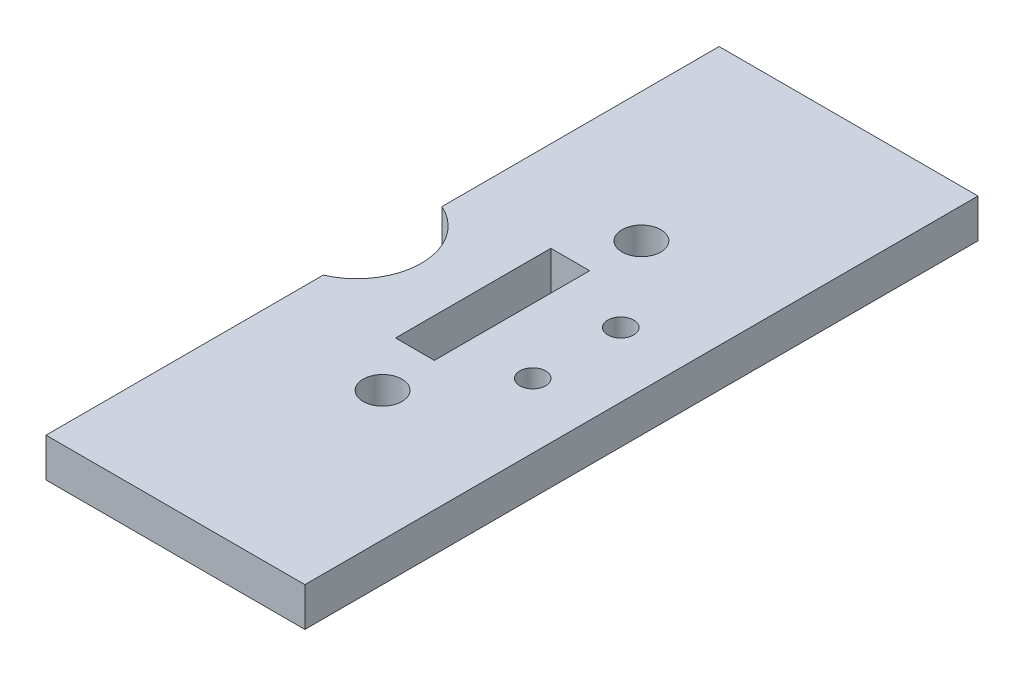
ISO-10303-21;
HEADER;
FILE_DESCRIPTION(('STEP AP214'),'2;1');
FILE_NAME('part.step','',(''),(''),'','','');
FILE_SCHEMA(('AUTOMOTIVE_DESIGN { 1 0 10303 214 1 1 1 1 }'));
ENDSEC;
DATA;
#1=APPLICATION_CONTEXT('core data for automotive mechanical design processes');
#2=APPLICATION_PROTOCOL_DEFINITION('international standard','automotive_design',2000,#1);
#3=PRODUCT_CONTEXT('',#1,'mechanical');
#4=PRODUCT('Part','Part','',(#3));
#5=PRODUCT_RELATED_PRODUCT_CATEGORY('part','',(#4));
#6=PRODUCT_DEFINITION_FORMATION('','',#4);
#7=PRODUCT_DEFINITION_CONTEXT('part definition',#1,'design');
#8=PRODUCT_DEFINITION('design','',#6,#7);
#9=PRODUCT_DEFINITION_SHAPE('','',#8);
#10=(LENGTH_UNIT() NAMED_UNIT(*) SI_UNIT(.MILLI.,.METRE.));
#11=(NAMED_UNIT(*) PLANE_ANGLE_UNIT() SI_UNIT($,.RADIAN.));
#12=(NAMED_UNIT(*) SI_UNIT($,.STERADIAN.) SOLID_ANGLE_UNIT());
#13=UNCERTAINTY_MEASURE_WITH_UNIT(LENGTH_MEASURE(1.E-05),#10,'distance_accuracy_value','');
#14=(GEOMETRIC_REPRESENTATION_CONTEXT(3) GLOBAL_UNCERTAINTY_ASSIGNED_CONTEXT((#13)) GLOBAL_UNIT_ASSIGNED_CONTEXT((#10,
#11,#12)) REPRESENTATION_CONTEXT('',''));
#15=CARTESIAN_POINT('',(0.,0.,0.));
#16=DIRECTION('',(0.,0.,1.));
#17=DIRECTION('',(1.,0.,0.));
#18=AXIS2_PLACEMENT_3D('',#15,#16,#17);
#19=CARTESIAN_POINT('',(-21.9860369151843,3.,5.9334090687444));
#20=DIRECTION('',(1.,0.,0.));
#21=DIRECTION('',(0.,0.,-1.));
#22=AXIS2_PLACEMENT_3D('',#19,#20,#21);
#23=PLANE('',#22);
#24=DIRECTION('',(0.,0.,1.));
#25=VECTOR('',#24,1.);
#26=CARTESIAN_POINT('',(-21.9860369151843,0.,5.9334090687444));
#27=LINE('',#26,#25);
#28=CARTESIAN_POINT('',(-21.9860369151843,0.,5.9334090687444));
#29=VERTEX_POINT('',#28);
#30=CARTESIAN_POINT('',(-21.9860369151843,0.,27.3508333737886));
#31=VERTEX_POINT('',#30);
#32=EDGE_CURVE('E175',#29,#31,#27,.T.);
#33=ORIENTED_EDGE('',*,*,#32,.T.);
#34=DIRECTION('',(0.,1.,0.));
#35=VECTOR('',#34,1.);
#36=CARTESIAN_POINT('',(-21.9860369151843,0.,27.3508333737886));
#37=LINE('',#36,#35);
#38=CARTESIAN_POINT('',(-21.9860369151843,3.,27.3508333737886));
#39=VERTEX_POINT('',#38);
#40=EDGE_CURVE('E148',#31,#39,#37,.T.);
#41=ORIENTED_EDGE('',*,*,#40,.T.);
#42=DIRECTION('',(0.,0.,1.));
#43=VECTOR('',#42,1.);
#44=CARTESIAN_POINT('',(-21.9860369151843,3.,5.9334090687444));
#45=LINE('',#44,#43);
#46=CARTESIAN_POINT('',(-21.9860369151843,3.,5.9334090687444));
#47=VERTEX_POINT('',#46);
#48=EDGE_CURVE('E164',#47,#39,#45,.T.);
#49=ORIENTED_EDGE('',*,*,#48,.F.);
#50=DIRECTION('',(0.,-1.,0.));
#51=VECTOR('',#50,1.);
#52=CARTESIAN_POINT('',(-21.9860369151843,3.,5.9334090687444));
#53=LINE('',#52,#51);
#54=EDGE_CURVE('E174',#47,#29,#53,.T.);
#55=ORIENTED_EDGE('',*,*,#54,.T.);
#56=EDGE_LOOP('',(#33,#41,#49,#55));
#57=FACE_BOUND('',#56,.T.);
#58=ADVANCED_FACE('F33',(#57),#23,.F.);
#59=CARTESIAN_POINT('',(-21.9860369151843,3.,36.5159847637002));
#60=VERTEX_POINT('',#59);
#61=CARTESIAN_POINT('',(-21.9860369151843,3.,57.9334090687444));
#62=VERTEX_POINT('',#61);
#63=EDGE_CURVE('E168',#60,#62,#45,.T.);
#64=ORIENTED_EDGE('',*,*,#63,.F.);
#65=DIRECTION('',(0.,1.,0.));
#66=VECTOR('',#65,1.);
#67=CARTESIAN_POINT('',(-21.9860369151843,0.,36.5159847637002));
#68=LINE('',#67,#66);
#69=CARTESIAN_POINT('',(-21.9860369151843,0.,36.5159847637002));
#70=VERTEX_POINT('',#69);
#71=EDGE_CURVE('E144',#60,#70,#68,.F.);
#72=ORIENTED_EDGE('',*,*,#71,.T.);
#73=CARTESIAN_POINT('',(-21.9860369151843,0.,57.9334090687444));
#74=VERTEX_POINT('',#73);
#75=EDGE_CURVE('E161',#70,#74,#27,.T.);
#76=ORIENTED_EDGE('',*,*,#75,.T.);
#77=DIRECTION('',(0.,-1.,0.));
#78=VECTOR('',#77,1.);
#79=CARTESIAN_POINT('',(-21.9860369151843,3.,57.9334090687444));
#80=LINE('',#79,#78);
#81=EDGE_CURVE('E192',#62,#74,#80,.T.);
#82=ORIENTED_EDGE('',*,*,#81,.F.);
#83=EDGE_LOOP('',(#64,#72,#76,#82));
#84=FACE_BOUND('',#83,.T.);
#85=ADVANCED_FACE('F35',(#84),#23,.F.);
#86=CARTESIAN_POINT('',(-21.9860369151843,3.,57.9334090687444));
#87=DIRECTION('',(0.,0.,-1.));
#88=DIRECTION('',(-1.,0.,0.));
#89=AXIS2_PLACEMENT_3D('',#86,#87,#88);
#90=PLANE('',#89);
#91=DIRECTION('',(1.,0.,0.));
#92=VECTOR('',#91,1.);
#93=CARTESIAN_POINT('',(-21.9860369151843,0.,57.9334090687444));
#94=LINE('',#93,#92);
#95=CARTESIAN_POINT('',(-1.98603691518428,0.,57.9334090687444));
#96=VERTEX_POINT('',#95);
#97=EDGE_CURVE('E178',#74,#96,#94,.T.);
#98=ORIENTED_EDGE('',*,*,#97,.T.);
#99=DIRECTION('',(0.,-1.,0.));
#100=VECTOR('',#99,1.);
#101=CARTESIAN_POINT('',(-1.98603691518428,3.,57.9334090687444));
#102=LINE('',#101,#100);
#103=CARTESIAN_POINT('',(-1.98603691518428,3.,57.9334090687444));
#104=VERTEX_POINT('',#103);
#105=EDGE_CURVE('E189',#104,#96,#102,.T.);
#106=ORIENTED_EDGE('',*,*,#105,.F.);
#107=DIRECTION('',(1.,0.,0.));
#108=VECTOR('',#107,1.);
#109=CARTESIAN_POINT('',(-21.9860369151843,3.,57.9334090687444));
#110=LINE('',#109,#108);
#111=EDGE_CURVE('E167',#62,#104,#110,.T.);
#112=ORIENTED_EDGE('',*,*,#111,.F.);
#113=ORIENTED_EDGE('',*,*,#81,.T.);
#114=EDGE_LOOP('',(#98,#106,#112,#113));
#115=FACE_BOUND('',#114,.T.);
#116=ADVANCED_FACE('F239',(#115),#90,.F.);
#117=CARTESIAN_POINT('',(-1.98603691518429,3.,5.9334090687444));
#118=DIRECTION('',(-1.,0.,0.));
#119=DIRECTION('',(0.,0.,1.));
#120=AXIS2_PLACEMENT_3D('',#117,#118,#119);
#121=PLANE('',#120);
#122=DIRECTION('',(0.,0.,-1.));
#123=VECTOR('',#122,1.);
#124=CARTESIAN_POINT('',(-1.98603691518429,0.,5.9334090687444));
#125=LINE('',#124,#123);
#126=CARTESIAN_POINT('',(-1.98603691518429,0.,5.9334090687444));
#127=VERTEX_POINT('',#126);
#128=EDGE_CURVE('E180',#96,#127,#125,.T.);
#129=ORIENTED_EDGE('',*,*,#128,.T.);
#130=DIRECTION('',(0.,-1.,0.));
#131=VECTOR('',#130,1.);
#132=CARTESIAN_POINT('',(-1.98603691518429,3.,5.9334090687444));
#133=LINE('',#132,#131);
#134=CARTESIAN_POINT('',(-1.98603691518429,3.,5.9334090687444));
#135=VERTEX_POINT('',#134);
#136=EDGE_CURVE('E186',#135,#127,#133,.T.);
#137=ORIENTED_EDGE('',*,*,#136,.F.);
#138=DIRECTION('',(0.,0.,-1.));
#139=VECTOR('',#138,1.);
#140=CARTESIAN_POINT('',(-1.98603691518429,3.,5.9334090687444));
#141=LINE('',#140,#139);
#142=EDGE_CURVE('E170',#104,#135,#141,.T.);
#143=ORIENTED_EDGE('',*,*,#142,.F.);
#144=ORIENTED_EDGE('',*,*,#105,.T.);
#145=EDGE_LOOP('',(#129,#137,#143,#144));
#146=FACE_BOUND('',#145,.T.);
#147=ADVANCED_FACE('F230',(#146),#121,.F.);
#148=CARTESIAN_POINT('',(-21.9860369151843,3.,5.9334090687444));
#149=DIRECTION('',(0.,0.,1.));
#150=DIRECTION('',(1.,0.,0.));
#151=AXIS2_PLACEMENT_3D('',#148,#149,#150);
#152=PLANE('',#151);
#153=DIRECTION('',(-1.,0.,0.));
#154=VECTOR('',#153,1.);
#155=CARTESIAN_POINT('',(-21.9860369151843,0.,5.9334090687444));
#156=LINE('',#155,#154);
#157=EDGE_CURVE('E182',#127,#29,#156,.T.);
#158=ORIENTED_EDGE('',*,*,#157,.T.);
#159=ORIENTED_EDGE('',*,*,#54,.F.);
#160=DIRECTION('',(-1.,0.,0.));
#161=VECTOR('',#160,1.);
#162=CARTESIAN_POINT('',(-21.9860369151843,3.,5.9334090687444));
#163=LINE('',#162,#161);
#164=EDGE_CURVE('E172',#135,#47,#163,.T.);
#165=ORIENTED_EDGE('',*,*,#164,.F.);
#166=ORIENTED_EDGE('',*,*,#136,.T.);
#167=EDGE_LOOP('',(#158,#159,#165,#166));
#168=FACE_BOUND('',#167,.T.);
#169=ADVANCED_FACE('F220',(#168),#152,.F.);
#170=CARTESIAN_POINT('',(0.,3.,0.));
#171=DIRECTION('',(0.,1.,0.));
#172=DIRECTION('',(0.,0.,1.));
#173=AXIS2_PLACEMENT_3D('',#170,#171,#172);
#174=PLANE('',#173);
#175=CARTESIAN_POINT('',(-6.98603691518428,3.,28.5309847637002));
#176=DIRECTION('',(0.,1.,0.));
#177=DIRECTION('',(0.,0.,1.));
#178=AXIS2_PLACEMENT_3D('',#175,#176,#177);
#179=CIRCLE('',#178,1.);
#180=CARTESIAN_POINT('',(-6.98603691518428,3.,29.5309847637002));
#181=VERTEX_POINT('',#180);
#182=EDGE_CURVE('E209',#181,#181,#179,.T.);
#183=ORIENTED_EDGE('',*,*,#182,.F.);
#184=EDGE_LOOP('',(#183));
#185=FACE_BOUND('',#184,.T.);
#186=CARTESIAN_POINT('',(-6.98603691518428,3.,35.3309847637002));
#187=DIRECTION('',(0.,1.,0.));
#188=DIRECTION('',(0.,0.,1.));
#189=AXIS2_PLACEMENT_3D('',#186,#187,#188);
#190=CIRCLE('',#189,1.);
#191=CARTESIAN_POINT('',(-6.98603691518428,3.,36.3309847637002));
#192=VERTEX_POINT('',#191);
#193=EDGE_CURVE('E201',#192,#192,#190,.T.);
#194=ORIENTED_EDGE('',*,*,#193,.F.);
#195=EDGE_LOOP('',(#194));
#196=FACE_BOUND('',#195,.T.);
#197=DIRECTION('',(0.,0.,-1.));
#198=VECTOR('',#197,1.);
#199=CARTESIAN_POINT('',(-11.9860369151843,3.,37.9309847637002));
#200=LINE('',#199,#198);
#201=CARTESIAN_POINT('',(-11.9860369151843,3.,37.9309847637002));
#202=VERTEX_POINT('',#201);
#203=CARTESIAN_POINT('',(-11.9860369151843,3.,25.9309847637002));
#204=VERTEX_POINT('',#203);
#205=EDGE_CURVE('E50',#202,#204,#200,.T.);
#206=ORIENTED_EDGE('',*,*,#205,.F.);
#207=DIRECTION('',(1.,0.,0.));
#208=VECTOR('',#207,1.);
#209=CARTESIAN_POINT('',(-11.9860369151843,3.,37.9309847637002));
#210=LINE('',#209,#208);
#211=CARTESIAN_POINT('',(-14.9860369151843,3.,37.9309847637002));
#212=VERTEX_POINT('',#211);
#213=EDGE_CURVE('E131',#212,#202,#210,.T.);
#214=ORIENTED_EDGE('',*,*,#213,.F.);
#215=DIRECTION('',(0.,0.,1.));
#216=VECTOR('',#215,1.);
#217=CARTESIAN_POINT('',(-14.9860369151843,3.,37.9309847637002));
#218=LINE('',#217,#216);
#219=CARTESIAN_POINT('',(-14.9860369151843,3.,25.9309847637002));
#220=VERTEX_POINT('',#219);
#221=EDGE_CURVE('E115',#220,#212,#218,.T.);
#222=ORIENTED_EDGE('',*,*,#221,.F.);
#223=DIRECTION('',(-1.,0.,0.));
#224=VECTOR('',#223,1.);
#225=CARTESIAN_POINT('',(-11.9860369151843,3.,25.9309847637002));
#226=LINE('',#225,#224);
#227=EDGE_CURVE('E124',#204,#220,#226,.T.);
#228=ORIENTED_EDGE('',*,*,#227,.F.);
#229=EDGE_LOOP('',(#206,#214,#222,#228));
#230=FACE_BOUND('',#229,.T.);
#231=CARTESIAN_POINT('',(-23.9860369151843,3.,31.9334090687444));
#232=DIRECTION('',(0.,1.,0.));
#233=DIRECTION('',(0.,0.,1.));
#234=AXIS2_PLACEMENT_3D('',#231,#232,#233);
#235=CIRCLE('',#234,5.);
#236=EDGE_CURVE('E138',#60,#39,#235,.T.);
#237=ORIENTED_EDGE('',*,*,#236,.F.);
#238=ORIENTED_EDGE('',*,*,#63,.T.);
#239=ORIENTED_EDGE('',*,*,#111,.T.);
#240=ORIENTED_EDGE('',*,*,#142,.T.);
#241=ORIENTED_EDGE('',*,*,#164,.T.);
#242=ORIENTED_EDGE('',*,*,#48,.T.);
#243=EDGE_LOOP('',(#237,#238,#239,#240,#241,#242));
#244=FACE_BOUND('',#243,.T.);
#245=CARTESIAN_POINT('',(-11.9860369151843,3.,21.9334090687444));
#246=DIRECTION('',(0.,1.,0.));
#247=DIRECTION('',(0.,0.,1.));
#248=AXIS2_PLACEMENT_3D('',#245,#246,#247);
#249=CIRCLE('',#248,1.5);
#250=CARTESIAN_POINT('',(-11.9860369151843,3.,23.4334090687444));
#251=VERTEX_POINT('',#250);
#252=EDGE_CURVE('E151',#251,#251,#249,.T.);
#253=ORIENTED_EDGE('',*,*,#252,.F.);
#254=EDGE_LOOP('',(#253));
#255=FACE_BOUND('',#254,.T.);
#256=CARTESIAN_POINT('',(-11.9860369151843,3.,41.9334090687444));
#257=DIRECTION('',(0.,1.,0.));
#258=DIRECTION('',(0.,0.,1.));
#259=AXIS2_PLACEMENT_3D('',#256,#257,#258);
#260=CIRCLE('',#259,1.5);
#261=CARTESIAN_POINT('',(-11.9860369151843,3.,43.4334090687444));
#262=VERTEX_POINT('',#261);
#263=EDGE_CURVE('E155',#262,#262,#260,.T.);
#264=ORIENTED_EDGE('',*,*,#263,.F.);
#265=EDGE_LOOP('',(#264));
#266=FACE_BOUND('',#265,.T.);
#267=ADVANCED_FACE('F128',(#185,#196,#230,#244,#255,#266),#174,.T.);
#268=CARTESIAN_POINT('',(0.,0.,0.));
#269=DIRECTION('',(0.,1.,0.));
#270=DIRECTION('',(0.,0.,1.));
#271=AXIS2_PLACEMENT_3D('',#268,#269,#270);
#272=PLANE('',#271);
#273=CARTESIAN_POINT('',(-6.98603691518428,0.,28.5309847637002));
#274=DIRECTION('',(0.,1.,0.));
#275=DIRECTION('',(0.,0.,1.));
#276=AXIS2_PLACEMENT_3D('',#273,#274,#275);
#277=CIRCLE('',#276,1.);
#278=CARTESIAN_POINT('',(-6.98603691518428,0.,29.5309847637002));
#279=VERTEX_POINT('',#278);
#280=EDGE_CURVE('E37',#279,#279,#277,.T.);
#281=ORIENTED_EDGE('',*,*,#280,.T.);
#282=EDGE_LOOP('',(#281));
#283=FACE_BOUND('',#282,.T.);
#284=CARTESIAN_POINT('',(-6.98603691518428,0.,35.3309847637002));
#285=DIRECTION('',(0.,1.,0.));
#286=DIRECTION('',(0.,0.,1.));
#287=AXIS2_PLACEMENT_3D('',#284,#285,#286);
#288=CIRCLE('',#287,1.);
#289=CARTESIAN_POINT('',(-6.98603691518428,0.,36.3309847637002));
#290=VERTEX_POINT('',#289);
#291=EDGE_CURVE('E199',#290,#290,#288,.T.);
#292=ORIENTED_EDGE('',*,*,#291,.T.);
#293=EDGE_LOOP('',(#292));
#294=FACE_BOUND('',#293,.T.);
#295=DIRECTION('',(1.,0.,0.));
#296=VECTOR('',#295,1.);
#297=CARTESIAN_POINT('',(0.,0.,37.9309847637002));
#298=LINE('',#297,#296);
#299=CARTESIAN_POINT('',(-14.9860369151843,0.,37.9309847637002));
#300=VERTEX_POINT('',#299);
#301=CARTESIAN_POINT('',(-11.9860369151843,0.,37.9309847637002));
#302=VERTEX_POINT('',#301);
#303=EDGE_CURVE('E42',#300,#302,#298,.T.);
#304=ORIENTED_EDGE('',*,*,#303,.T.);
#305=DIRECTION('',(0.,0.,-1.));
#306=VECTOR('',#305,1.);
#307=CARTESIAN_POINT('',(-11.9860369151843,0.,0.));
#308=LINE('',#307,#306);
#309=CARTESIAN_POINT('',(-11.9860369151843,0.,25.9309847637002));
#310=VERTEX_POINT('',#309);
#311=EDGE_CURVE('E11',#302,#310,#308,.T.);
#312=ORIENTED_EDGE('',*,*,#311,.T.);
#313=DIRECTION('',(-1.,0.,0.));
#314=VECTOR('',#313,1.);
#315=CARTESIAN_POINT('',(0.,0.,25.9309847637002));
#316=LINE('',#315,#314);
#317=CARTESIAN_POINT('',(-14.9860369151843,0.,25.9309847637002));
#318=VERTEX_POINT('',#317);
#319=EDGE_CURVE('E195',#310,#318,#316,.T.);
#320=ORIENTED_EDGE('',*,*,#319,.T.);
#321=DIRECTION('',(0.,0.,1.));
#322=VECTOR('',#321,1.);
#323=CARTESIAN_POINT('',(-14.9860369151843,0.,0.));
#324=LINE('',#323,#322);
#325=EDGE_CURVE('E118',#318,#300,#324,.T.);
#326=ORIENTED_EDGE('',*,*,#325,.T.);
#327=EDGE_LOOP('',(#304,#312,#320,#326));
#328=FACE_BOUND('',#327,.T.);
#329=CARTESIAN_POINT('',(-11.9860369151843,0.,21.9334090687444));
#330=DIRECTION('',(0.,1.,0.));
#331=DIRECTION('',(0.,0.,1.));
#332=AXIS2_PLACEMENT_3D('',#329,#330,#331);
#333=CIRCLE('',#332,1.5);
#334=CARTESIAN_POINT('',(-11.9860369151843,0.,23.4334090687444));
#335=VERTEX_POINT('',#334);
#336=EDGE_CURVE('E152',#335,#335,#333,.T.);
#337=ORIENTED_EDGE('',*,*,#336,.T.);
#338=EDGE_LOOP('',(#337));
#339=FACE_BOUND('',#338,.T.);
#340=CARTESIAN_POINT('',(-11.9860369151843,0.,41.9334090687444));
#341=DIRECTION('',(0.,1.,0.));
#342=DIRECTION('',(0.,0.,1.));
#343=AXIS2_PLACEMENT_3D('',#340,#341,#342);
#344=CIRCLE('',#343,1.5);
#345=CARTESIAN_POINT('',(-11.9860369151843,0.,43.4334090687444));
#346=VERTEX_POINT('',#345);
#347=EDGE_CURVE('E158',#346,#346,#344,.T.);
#348=ORIENTED_EDGE('',*,*,#347,.T.);
#349=EDGE_LOOP('',(#348));
#350=FACE_BOUND('',#349,.T.);
#351=ORIENTED_EDGE('',*,*,#75,.F.);
#352=CARTESIAN_POINT('',(-23.9860369151843,0.,31.9334090687444));
#353=DIRECTION('',(0.,1.,0.));
#354=DIRECTION('',(0.,0.,1.));
#355=AXIS2_PLACEMENT_3D('',#352,#353,#354);
#356=CIRCLE('',#355,5.);
#357=EDGE_CURVE('E141',#70,#31,#356,.T.);
#358=ORIENTED_EDGE('',*,*,#357,.T.);
#359=ORIENTED_EDGE('',*,*,#32,.F.);
#360=ORIENTED_EDGE('',*,*,#157,.F.);
#361=ORIENTED_EDGE('',*,*,#128,.F.);
#362=ORIENTED_EDGE('',*,*,#97,.F.);
#363=EDGE_LOOP('',(#351,#358,#359,#360,#361,#362));
#364=FACE_BOUND('',#363,.T.);
#365=ADVANCED_FACE('F219',(#283,#294,#328,#339,#350,#364),#272,.F.);
#366=CARTESIAN_POINT('',(-11.9860369151843,0.,41.9334090687444));
#367=DIRECTION('',(0.,1.,0.));
#368=DIRECTION('',(0.,0.,1.));
#369=AXIS2_PLACEMENT_3D('',#366,#367,#368);
#370=CYLINDRICAL_SURFACE('',#369,1.5);
#371=ORIENTED_EDGE('',*,*,#347,.F.);
#372=EDGE_LOOP('',(#371));
#373=FACE_BOUND('',#372,.T.);
#374=ORIENTED_EDGE('',*,*,#263,.T.);
#375=EDGE_LOOP('',(#374));
#376=FACE_BOUND('',#375,.T.);
#377=ADVANCED_FACE('F226',(#373,#376),#370,.F.);
#378=CARTESIAN_POINT('',(-11.9860369151843,0.,21.9334090687444));
#379=DIRECTION('',(0.,1.,0.));
#380=DIRECTION('',(0.,0.,1.));
#381=AXIS2_PLACEMENT_3D('',#378,#379,#380);
#382=CYLINDRICAL_SURFACE('',#381,1.5);
#383=ORIENTED_EDGE('',*,*,#336,.F.);
#384=EDGE_LOOP('',(#383));
#385=FACE_BOUND('',#384,.T.);
#386=ORIENTED_EDGE('',*,*,#252,.T.);
#387=EDGE_LOOP('',(#386));
#388=FACE_BOUND('',#387,.T.);
#389=ADVANCED_FACE('F286',(#385,#388),#382,.F.);
#390=CARTESIAN_POINT('',(-23.9860369151843,0.,31.9334090687444));
#391=DIRECTION('',(0.,1.,0.));
#392=DIRECTION('',(0.,0.,1.));
#393=AXIS2_PLACEMENT_3D('',#390,#391,#392);
#394=CYLINDRICAL_SURFACE('',#393,5.);
#395=ORIENTED_EDGE('',*,*,#357,.F.);
#396=ORIENTED_EDGE('',*,*,#71,.F.);
#397=ORIENTED_EDGE('',*,*,#236,.T.);
#398=ORIENTED_EDGE('',*,*,#40,.F.);
#399=EDGE_LOOP('',(#395,#396,#397,#398));
#400=FACE_BOUND('',#399,.T.);
#401=ADVANCED_FACE('F250',(#400),#394,.F.);
#402=CARTESIAN_POINT('',(-11.9860369151843,-7.,37.9309847637002));
#403=DIRECTION('',(1.,0.,0.));
#404=DIRECTION('',(0.,0.,-1.));
#405=AXIS2_PLACEMENT_3D('',#402,#403,#404);
#406=PLANE('',#405);
#407=DIRECTION('',(0.,1.,0.));
#408=VECTOR('',#407,1.);
#409=CARTESIAN_POINT('',(-11.9860369151843,-7.,37.9309847637002));
#410=LINE('',#409,#408);
#411=EDGE_CURVE('E136',#302,#202,#410,.T.);
#412=ORIENTED_EDGE('',*,*,#411,.T.);
#413=ORIENTED_EDGE('',*,*,#205,.T.);
#414=DIRECTION('',(0.,1.,0.));
#415=VECTOR('',#414,1.);
#416=CARTESIAN_POINT('',(-11.9860369151843,-7.,25.9309847637002));
#417=LINE('',#416,#415);
#418=EDGE_CURVE('E121',#310,#204,#417,.T.);
#419=ORIENTED_EDGE('',*,*,#418,.F.);
#420=ORIENTED_EDGE('',*,*,#311,.F.);
#421=EDGE_LOOP('',(#412,#413,#419,#420));
#422=FACE_BOUND('',#421,.T.);
#423=ADVANCED_FACE('F285',(#422),#406,.F.);
#424=CARTESIAN_POINT('',(-11.9860369151843,-7.,37.9309847637002));
#425=DIRECTION('',(0.,0.,1.));
#426=DIRECTION('',(1.,0.,0.));
#427=AXIS2_PLACEMENT_3D('',#424,#425,#426);
#428=PLANE('',#427);
#429=DIRECTION('',(0.,1.,0.));
#430=VECTOR('',#429,1.);
#431=CARTESIAN_POINT('',(-14.9860369151843,-7.,37.9309847637002));
#432=LINE('',#431,#430);
#433=EDGE_CURVE('E120',#300,#212,#432,.T.);
#434=ORIENTED_EDGE('',*,*,#433,.T.);
#435=ORIENTED_EDGE('',*,*,#213,.T.);
#436=ORIENTED_EDGE('',*,*,#411,.F.);
#437=ORIENTED_EDGE('',*,*,#303,.F.);
#438=EDGE_LOOP('',(#434,#435,#436,#437));
#439=FACE_BOUND('',#438,.T.);
#440=ADVANCED_FACE('F296',(#439),#428,.F.);
#441=CARTESIAN_POINT('',(-14.9860369151843,-7.,37.9309847637002));
#442=DIRECTION('',(-1.,0.,0.));
#443=DIRECTION('',(0.,0.,1.));
#444=AXIS2_PLACEMENT_3D('',#441,#442,#443);
#445=PLANE('',#444);
#446=DIRECTION('',(0.,1.,0.));
#447=VECTOR('',#446,1.);
#448=CARTESIAN_POINT('',(-14.9860369151843,-7.,25.9309847637002));
#449=LINE('',#448,#447);
#450=EDGE_CURVE('E58',#318,#220,#449,.T.);
#451=ORIENTED_EDGE('',*,*,#450,.T.);
#452=ORIENTED_EDGE('',*,*,#221,.T.);
#453=ORIENTED_EDGE('',*,*,#433,.F.);
#454=ORIENTED_EDGE('',*,*,#325,.F.);
#455=EDGE_LOOP('',(#451,#452,#453,#454));
#456=FACE_BOUND('',#455,.T.);
#457=ADVANCED_FACE('F112',(#456),#445,.F.);
#458=CARTESIAN_POINT('',(-11.9860369151843,-7.,25.9309847637002));
#459=DIRECTION('',(0.,0.,-1.));
#460=DIRECTION('',(-1.,0.,0.));
#461=AXIS2_PLACEMENT_3D('',#458,#459,#460);
#462=PLANE('',#461);
#463=ORIENTED_EDGE('',*,*,#418,.T.);
#464=ORIENTED_EDGE('',*,*,#227,.T.);
#465=ORIENTED_EDGE('',*,*,#450,.F.);
#466=ORIENTED_EDGE('',*,*,#319,.F.);
#467=EDGE_LOOP('',(#463,#464,#465,#466));
#468=FACE_BOUND('',#467,.T.);
#469=ADVANCED_FACE('F125',(#468),#462,.F.);
#470=CARTESIAN_POINT('',(-6.98603691518428,-7.,35.3309847637002));
#471=DIRECTION('',(0.,1.,0.));
#472=DIRECTION('',(0.,0.,1.));
#473=AXIS2_PLACEMENT_3D('',#470,#471,#472);
#474=CYLINDRICAL_SURFACE('',#473,1.);
#475=ORIENTED_EDGE('',*,*,#193,.T.);
#476=EDGE_LOOP('',(#475));
#477=FACE_BOUND('',#476,.T.);
#478=ORIENTED_EDGE('',*,*,#291,.F.);
#479=EDGE_LOOP('',(#478));
#480=FACE_BOUND('',#479,.T.);
#481=ADVANCED_FACE('F320',(#477,#480),#474,.F.);
#482=CARTESIAN_POINT('',(-6.98603691518428,-7.,28.5309847637002));
#483=DIRECTION('',(0.,1.,0.));
#484=DIRECTION('',(0.,0.,1.));
#485=AXIS2_PLACEMENT_3D('',#482,#483,#484);
#486=CYLINDRICAL_SURFACE('',#485,1.);
#487=ORIENTED_EDGE('',*,*,#182,.T.);
#488=EDGE_LOOP('',(#487));
#489=FACE_BOUND('',#488,.T.);
#490=ORIENTED_EDGE('',*,*,#280,.F.);
#491=EDGE_LOOP('',(#490));
#492=FACE_BOUND('',#491,.T.);
#493=ADVANCED_FACE('F214',(#489,#492),#486,.F.);
#494=CLOSED_SHELL('',(#58,#85,#116,#147,#169,#267,#365,#377,#389,#401,#423,#440,#457,#469,#481,#493));
#495=MANIFOLD_SOLID_BREP('B2',#494);
#496=ADVANCED_BREP_SHAPE_REPRESENTATION('',(#18,#495),#14);
#497=SHAPE_DEFINITION_REPRESENTATION(#9,#496);
ENDSEC;
END-ISO-10303-21;
